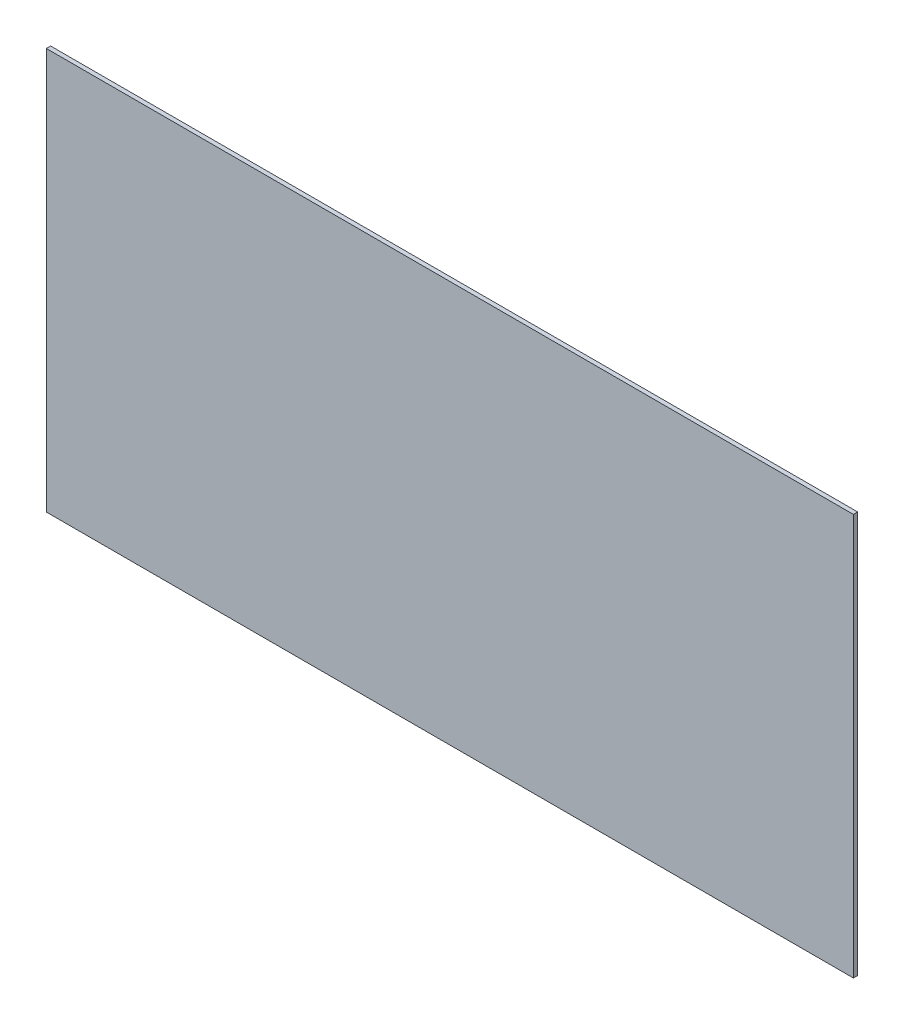
ISO-10303-21;
HEADER;
FILE_DESCRIPTION(('STEP AP214'),'2;1');
FILE_NAME('part.step','',(''),(''),'','','');
FILE_SCHEMA(('AUTOMOTIVE_DESIGN { 1 0 10303 214 1 1 1 1 }'));
ENDSEC;
DATA;
#1=APPLICATION_CONTEXT('core data for automotive mechanical design processes');
#2=APPLICATION_PROTOCOL_DEFINITION('international standard','automotive_design',2000,#1);
#3=PRODUCT_CONTEXT('',#1,'mechanical');
#4=PRODUCT('Part','Part','',(#3));
#5=PRODUCT_RELATED_PRODUCT_CATEGORY('part','',(#4));
#6=PRODUCT_DEFINITION_FORMATION('','',#4);
#7=PRODUCT_DEFINITION_CONTEXT('part definition',#1,'design');
#8=PRODUCT_DEFINITION('design','',#6,#7);
#9=PRODUCT_DEFINITION_SHAPE('','',#8);
#10=(LENGTH_UNIT() NAMED_UNIT(*) SI_UNIT(.MILLI.,.METRE.));
#11=(NAMED_UNIT(*) PLANE_ANGLE_UNIT() SI_UNIT($,.RADIAN.));
#12=(NAMED_UNIT(*) SI_UNIT($,.STERADIAN.) SOLID_ANGLE_UNIT());
#13=UNCERTAINTY_MEASURE_WITH_UNIT(LENGTH_MEASURE(1.E-05),#10,'distance_accuracy_value','');
#14=(GEOMETRIC_REPRESENTATION_CONTEXT(3) GLOBAL_UNCERTAINTY_ASSIGNED_CONTEXT((#13)) GLOBAL_UNIT_ASSIGNED_CONTEXT((#10,
#11,#12)) REPRESENTATION_CONTEXT('',''));
#15=CARTESIAN_POINT('',(0.,0.,0.));
#16=DIRECTION('',(0.,0.,1.));
#17=DIRECTION('',(1.,0.,0.));
#18=AXIS2_PLACEMENT_3D('',#15,#16,#17);
#19=CARTESIAN_POINT('',(-132.409854076381,76.3066901408451,1.5875));
#20=DIRECTION('',(1.,0.,0.));
#21=DIRECTION('',(0.,0.,-1.));
#22=AXIS2_PLACEMENT_3D('',#19,#20,#21);
#23=PLANE('',#22);
#24=DIRECTION('',(0.,-1.,0.));
#25=VECTOR('',#24,1.);
#26=CARTESIAN_POINT('',(-132.409854076381,76.3066901408451,0.));
#27=LINE('',#26,#25);
#28=CARTESIAN_POINT('',(-132.409854076381,76.3066901408451,0.));
#29=VERTEX_POINT('',#28);
#30=CARTESIAN_POINT('',(-132.409854076381,-72.9433098591549,0.));
#31=VERTEX_POINT('',#30);
#32=EDGE_CURVE('E96',#29,#31,#27,.T.);
#33=ORIENTED_EDGE('',*,*,#32,.T.);
#34=DIRECTION('',(0.,0.,-1.));
#35=VECTOR('',#34,1.);
#36=CARTESIAN_POINT('',(-132.409854076381,-72.9433098591549,1.5875));
#37=LINE('',#36,#35);
#38=CARTESIAN_POINT('',(-132.409854076381,-72.9433098591549,1.5875));
#39=VERTEX_POINT('',#38);
#40=EDGE_CURVE('E11',#39,#31,#37,.T.);
#41=ORIENTED_EDGE('',*,*,#40,.F.);
#42=DIRECTION('',(0.,-1.,0.));
#43=VECTOR('',#42,1.);
#44=CARTESIAN_POINT('',(-132.409854076381,76.3066901408451,1.5875));
#45=LINE('',#44,#43);
#46=CARTESIAN_POINT('',(-132.409854076381,76.3066901408451,1.5875));
#47=VERTEX_POINT('',#46);
#48=EDGE_CURVE('E84',#47,#39,#45,.T.);
#49=ORIENTED_EDGE('',*,*,#48,.F.);
#50=DIRECTION('',(0.,0.,-1.));
#51=VECTOR('',#50,1.);
#52=CARTESIAN_POINT('',(-132.409854076381,76.3066901408451,1.5875));
#53=LINE('',#52,#51);
#54=EDGE_CURVE('E92',#47,#29,#53,.T.);
#55=ORIENTED_EDGE('',*,*,#54,.T.);
#56=EDGE_LOOP('',(#33,#41,#49,#55));
#57=FACE_BOUND('',#56,.T.);
#58=ADVANCED_FACE('F33',(#57),#23,.F.);
#59=CARTESIAN_POINT('',(-132.409854076381,-72.9433098591549,1.5875));
#60=DIRECTION('',(0.,1.,0.));
#61=DIRECTION('',(-1.,0.,0.));
#62=AXIS2_PLACEMENT_3D('',#59,#60,#61);
#63=PLANE('',#62);
#64=DIRECTION('',(1.,0.,0.));
#65=VECTOR('',#64,1.);
#66=CARTESIAN_POINT('',(-132.409854076381,-72.9433098591549,0.));
#67=LINE('',#66,#65);
#68=CARTESIAN_POINT('',(167.590145923619,-72.9433098591549,0.));
#69=VERTEX_POINT('',#68);
#70=EDGE_CURVE('E88',#31,#69,#67,.T.);
#71=ORIENTED_EDGE('',*,*,#70,.T.);
#72=DIRECTION('',(0.,0.,-1.));
#73=VECTOR('',#72,1.);
#74=CARTESIAN_POINT('',(167.590145923619,-72.9433098591549,1.5875));
#75=LINE('',#74,#73);
#76=CARTESIAN_POINT('',(167.590145923619,-72.9433098591549,1.5875));
#77=VERTEX_POINT('',#76);
#78=EDGE_CURVE('E41',#77,#69,#75,.T.);
#79=ORIENTED_EDGE('',*,*,#78,.F.);
#80=DIRECTION('',(1.,0.,0.));
#81=VECTOR('',#80,1.);
#82=CARTESIAN_POINT('',(-132.409854076381,-72.9433098591549,1.5875));
#83=LINE('',#82,#81);
#84=EDGE_CURVE('E79',#39,#77,#83,.T.);
#85=ORIENTED_EDGE('',*,*,#84,.F.);
#86=ORIENTED_EDGE('',*,*,#40,.T.);
#87=EDGE_LOOP('',(#71,#79,#85,#86));
#88=FACE_BOUND('',#87,.T.);
#89=ADVANCED_FACE('F87',(#88),#63,.F.);
#90=CARTESIAN_POINT('',(167.590145923619,76.3066901408451,1.5875));
#91=DIRECTION('',(-1.,0.,0.));
#92=DIRECTION('',(0.,-1.,0.));
#93=AXIS2_PLACEMENT_3D('',#90,#91,#92);
#94=PLANE('',#93);
#95=DIRECTION('',(0.,1.,0.));
#96=VECTOR('',#95,1.);
#97=CARTESIAN_POINT('',(167.590145923619,76.3066901408451,0.));
#98=LINE('',#97,#96);
#99=CARTESIAN_POINT('',(167.590145923619,76.3066901408451,0.));
#100=VERTEX_POINT('',#99);
#101=EDGE_CURVE('E66',#69,#100,#98,.T.);
#102=ORIENTED_EDGE('',*,*,#101,.T.);
#103=DIRECTION('',(0.,0.,-1.));
#104=VECTOR('',#103,1.);
#105=CARTESIAN_POINT('',(167.590145923619,76.3066901408451,1.5875));
#106=LINE('',#105,#104);
#107=CARTESIAN_POINT('',(167.590145923619,76.3066901408451,1.5875));
#108=VERTEX_POINT('',#107);
#109=EDGE_CURVE('E89',#108,#100,#106,.T.);
#110=ORIENTED_EDGE('',*,*,#109,.F.);
#111=DIRECTION('',(0.,1.,0.));
#112=VECTOR('',#111,1.);
#113=CARTESIAN_POINT('',(167.590145923619,76.3066901408451,1.5875));
#114=LINE('',#113,#112);
#115=EDGE_CURVE('E82',#77,#108,#114,.T.);
#116=ORIENTED_EDGE('',*,*,#115,.F.);
#117=ORIENTED_EDGE('',*,*,#78,.T.);
#118=EDGE_LOOP('',(#102,#110,#116,#117));
#119=FACE_BOUND('',#118,.T.);
#120=ADVANCED_FACE('F90',(#119),#94,.F.);
#121=CARTESIAN_POINT('',(-132.409854076381,76.3066901408451,1.5875));
#122=DIRECTION('',(0.,-1.,0.));
#123=DIRECTION('',(0.,0.,-1.));
#124=AXIS2_PLACEMENT_3D('',#121,#122,#123);
#125=PLANE('',#124);
#126=DIRECTION('',(-1.,0.,0.));
#127=VECTOR('',#126,1.);
#128=CARTESIAN_POINT('',(-132.409854076381,76.3066901408451,0.));
#129=LINE('',#128,#127);
#130=EDGE_CURVE('E72',#100,#29,#129,.T.);
#131=ORIENTED_EDGE('',*,*,#130,.T.);
#132=ORIENTED_EDGE('',*,*,#54,.F.);
#133=DIRECTION('',(-1.,0.,0.));
#134=VECTOR('',#133,1.);
#135=CARTESIAN_POINT('',(-132.409854076381,76.3066901408451,1.5875));
#136=LINE('',#135,#134);
#137=EDGE_CURVE('E49',#108,#47,#136,.T.);
#138=ORIENTED_EDGE('',*,*,#137,.F.);
#139=ORIENTED_EDGE('',*,*,#109,.T.);
#140=EDGE_LOOP('',(#131,#132,#138,#139));
#141=FACE_BOUND('',#140,.T.);
#142=ADVANCED_FACE('F103',(#141),#125,.F.);
#143=CARTESIAN_POINT('',(0.,0.,1.5875));
#144=DIRECTION('',(0.,0.,1.));
#145=DIRECTION('',(1.,0.,0.));
#146=AXIS2_PLACEMENT_3D('',#143,#144,#145);
#147=PLANE('',#146);
#148=ORIENTED_EDGE('',*,*,#48,.T.);
#149=ORIENTED_EDGE('',*,*,#84,.T.);
#150=ORIENTED_EDGE('',*,*,#115,.T.);
#151=ORIENTED_EDGE('',*,*,#137,.T.);
#152=EDGE_LOOP('',(#148,#149,#150,#151));
#153=FACE_BOUND('',#152,.T.);
#154=ADVANCED_FACE('F80',(#153),#147,.T.);
#155=CARTESIAN_POINT('',(0.,0.,0.));
#156=DIRECTION('',(0.,0.,1.));
#157=DIRECTION('',(1.,0.,0.));
#158=AXIS2_PLACEMENT_3D('',#155,#156,#157);
#159=PLANE('',#158);
#160=ORIENTED_EDGE('',*,*,#32,.F.);
#161=ORIENTED_EDGE('',*,*,#130,.F.);
#162=ORIENTED_EDGE('',*,*,#101,.F.);
#163=ORIENTED_EDGE('',*,*,#70,.F.);
#164=EDGE_LOOP('',(#160,#161,#162,#163));
#165=FACE_BOUND('',#164,.T.);
#166=ADVANCED_FACE('F106',(#165),#159,.F.);
#167=CLOSED_SHELL('',(#58,#89,#120,#142,#154,#166));
#168=MANIFOLD_SOLID_BREP('B2',#167);
#169=ADVANCED_BREP_SHAPE_REPRESENTATION('',(#18,#168),#14);
#170=SHAPE_DEFINITION_REPRESENTATION(#9,#169);
ENDSEC;
END-ISO-10303-21;
